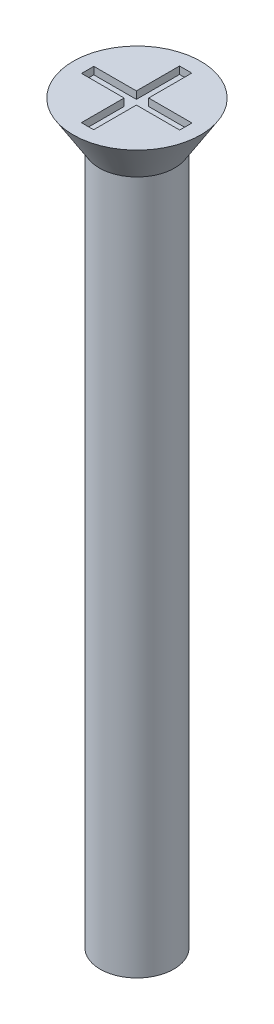
ISO-10303-21;
HEADER;
FILE_DESCRIPTION(('STEP AP214'),'2;1');
FILE_NAME('part.step','',(''),(''),'','','');
FILE_SCHEMA(('AUTOMOTIVE_DESIGN { 1 0 10303 214 1 1 1 1 }'));
ENDSEC;
DATA;
#1=APPLICATION_CONTEXT('core data for automotive mechanical design processes');
#2=APPLICATION_PROTOCOL_DEFINITION('international standard','automotive_design',2000,#1);
#3=PRODUCT_CONTEXT('',#1,'mechanical');
#4=PRODUCT('Part','Part','',(#3));
#5=PRODUCT_RELATED_PRODUCT_CATEGORY('part','',(#4));
#6=PRODUCT_DEFINITION_FORMATION('','',#4);
#7=PRODUCT_DEFINITION_CONTEXT('part definition',#1,'design');
#8=PRODUCT_DEFINITION('design','',#6,#7);
#9=PRODUCT_DEFINITION_SHAPE('','',#8);
#10=(LENGTH_UNIT() NAMED_UNIT(*) SI_UNIT(.MILLI.,.METRE.));
#11=(NAMED_UNIT(*) PLANE_ANGLE_UNIT() SI_UNIT($,.RADIAN.));
#12=(NAMED_UNIT(*) SI_UNIT($,.STERADIAN.) SOLID_ANGLE_UNIT());
#13=UNCERTAINTY_MEASURE_WITH_UNIT(LENGTH_MEASURE(1.E-05),#10,'distance_accuracy_value','');
#14=(GEOMETRIC_REPRESENTATION_CONTEXT(3) GLOBAL_UNCERTAINTY_ASSIGNED_CONTEXT((#13)) GLOBAL_UNIT_ASSIGNED_CONTEXT((#10,
#11,#12)) REPRESENTATION_CONTEXT('',''));
#15=CARTESIAN_POINT('',(0.,0.,0.));
#16=DIRECTION('',(0.,0.,1.));
#17=DIRECTION('',(1.,0.,0.));
#18=AXIS2_PLACEMENT_3D('',#15,#16,#17);
#19=CARTESIAN_POINT('',(0.,30.,0.));
#20=DIRECTION('',(0.,1.,0.));
#21=DIRECTION('',(0.,0.,1.));
#22=AXIS2_PLACEMENT_3D('',#19,#20,#21);
#23=PLANE('',#22);
#24=CARTESIAN_POINT('',(0.,30.,0.));
#25=DIRECTION('',(0.,1.,0.));
#26=DIRECTION('',(0.,0.,1.));
#27=AXIS2_PLACEMENT_3D('',#24,#25,#26);
#28=CIRCLE('',#27,2.6);
#29=CARTESIAN_POINT('',(0.,30.,2.6));
#30=VERTEX_POINT('',#29);
#31=EDGE_CURVE('E192',#30,#30,#28,.T.);
#32=ORIENTED_EDGE('',*,*,#31,.T.);
#33=EDGE_LOOP('',(#32));
#34=FACE_BOUND('',#33,.T.);
#35=DIRECTION('',(1.,0.,0.));
#36=VECTOR('',#35,1.);
#37=CARTESIAN_POINT('',(0.,30.,-2.));
#38=LINE('',#37,#36);
#39=CARTESIAN_POINT('',(-0.265272843023468,30.,-2.));
#40=VERTEX_POINT('',#39);
#41=CARTESIAN_POINT('',(0.234727156976532,30.,-2.));
#42=VERTEX_POINT('',#41);
#43=EDGE_CURVE('E161',#40,#42,#38,.T.);
#44=ORIENTED_EDGE('',*,*,#43,.T.);
#45=DIRECTION('',(0.,0.,1.));
#46=VECTOR('',#45,1.);
#47=CARTESIAN_POINT('',(0.234727156976532,30.,0.));
#48=LINE('',#47,#46);
#49=CARTESIAN_POINT('',(0.234727156976532,30.,-0.241621514992573));
#50=VERTEX_POINT('',#49);
#51=EDGE_CURVE('E48',#42,#50,#48,.T.);
#52=ORIENTED_EDGE('',*,*,#51,.T.);
#53=DIRECTION('',(1.,0.,0.));
#54=VECTOR('',#53,1.);
#55=CARTESIAN_POINT('',(0.,30.,-0.241621514992573));
#56=LINE('',#55,#54);
#57=CARTESIAN_POINT('',(2.,30.,-0.241621514992573));
#58=VERTEX_POINT('',#57);
#59=EDGE_CURVE('E98',#50,#58,#56,.T.);
#60=ORIENTED_EDGE('',*,*,#59,.T.);
#61=DIRECTION('',(0.,0.,1.));
#62=VECTOR('',#61,1.);
#63=CARTESIAN_POINT('',(2.,30.,0.));
#64=LINE('',#63,#62);
#65=CARTESIAN_POINT('',(2.,30.,0.258378485007427));
#66=VERTEX_POINT('',#65);
#67=EDGE_CURVE('E186',#58,#66,#64,.T.);
#68=ORIENTED_EDGE('',*,*,#67,.T.);
#69=DIRECTION('',(1.,0.,0.));
#70=VECTOR('',#69,1.);
#71=CARTESIAN_POINT('',(0.,30.,0.258378485007427));
#72=LINE('',#71,#70);
#73=CARTESIAN_POINT('',(0.234727156976532,30.,0.258378485007427));
#74=VERTEX_POINT('',#73);
#75=EDGE_CURVE('E145',#74,#66,#72,.T.);
#76=ORIENTED_EDGE('',*,*,#75,.F.);
#77=DIRECTION('',(0.,0.,1.));
#78=VECTOR('',#77,1.);
#79=CARTESIAN_POINT('',(0.234727156976532,30.,0.));
#80=LINE('',#79,#78);
#81=CARTESIAN_POINT('',(0.234727156976533,30.,2.));
#82=VERTEX_POINT('',#81);
#83=EDGE_CURVE('E182',#74,#82,#80,.T.);
#84=ORIENTED_EDGE('',*,*,#83,.T.);
#85=DIRECTION('',(1.,0.,0.));
#86=VECTOR('',#85,1.);
#87=CARTESIAN_POINT('',(0.,30.,2.));
#88=LINE('',#87,#86);
#89=CARTESIAN_POINT('',(-0.265272843023467,30.,2.));
#90=VERTEX_POINT('',#89);
#91=EDGE_CURVE('E179',#90,#82,#88,.T.);
#92=ORIENTED_EDGE('',*,*,#91,.F.);
#93=DIRECTION('',(0.,0.,1.));
#94=VECTOR('',#93,1.);
#95=CARTESIAN_POINT('',(-0.265272843023468,30.,0.));
#96=LINE('',#95,#94);
#97=CARTESIAN_POINT('',(-0.265272843023468,30.,0.258378485007427));
#98=VERTEX_POINT('',#97);
#99=EDGE_CURVE('E176',#98,#90,#96,.T.);
#100=ORIENTED_EDGE('',*,*,#99,.F.);
#101=DIRECTION('',(1.,0.,0.));
#102=VECTOR('',#101,1.);
#103=CARTESIAN_POINT('',(0.,30.,0.258378485007427));
#104=LINE('',#103,#102);
#105=CARTESIAN_POINT('',(-2.,30.,0.258378485007427));
#106=VERTEX_POINT('',#105);
#107=EDGE_CURVE('E173',#106,#98,#104,.T.);
#108=ORIENTED_EDGE('',*,*,#107,.F.);
#109=DIRECTION('',(0.,0.,1.));
#110=VECTOR('',#109,1.);
#111=CARTESIAN_POINT('',(-2.,30.,0.));
#112=LINE('',#111,#110);
#113=CARTESIAN_POINT('',(-2.,30.,-0.241621514992573));
#114=VERTEX_POINT('',#113);
#115=EDGE_CURVE('E170',#114,#106,#112,.T.);
#116=ORIENTED_EDGE('',*,*,#115,.F.);
#117=DIRECTION('',(1.,0.,0.));
#118=VECTOR('',#117,1.);
#119=CARTESIAN_POINT('',(0.,30.,-0.241621514992573));
#120=LINE('',#119,#118);
#121=CARTESIAN_POINT('',(-0.265272843023468,30.,-0.241621514992573));
#122=VERTEX_POINT('',#121);
#123=EDGE_CURVE('E167',#114,#122,#120,.T.);
#124=ORIENTED_EDGE('',*,*,#123,.T.);
#125=DIRECTION('',(0.,0.,1.));
#126=VECTOR('',#125,1.);
#127=CARTESIAN_POINT('',(-0.265272843023468,30.,0.));
#128=LINE('',#127,#126);
#129=EDGE_CURVE('E164',#40,#122,#128,.T.);
#130=ORIENTED_EDGE('',*,*,#129,.F.);
#131=EDGE_LOOP('',(#44,#52,#60,#68,#76,#84,#92,#100,#108,#116,#124,#130));
#132=FACE_BOUND('',#131,.T.);
#133=ADVANCED_FACE('F33',(#34,#132),#23,.T.);
#134=CARTESIAN_POINT('',(0.,30.,0.));
#135=DIRECTION('',(0.,-1.,0.));
#136=DIRECTION('',(0.,0.,-1.));
#137=AXIS2_PLACEMENT_3D('',#134,#135,#136);
#138=CYLINDRICAL_SURFACE('',#137,1.5);
#139=CARTESIAN_POINT('',(0.,0.,0.));
#140=DIRECTION('',(0.,1.,0.));
#141=DIRECTION('',(0.,0.,1.));
#142=AXIS2_PLACEMENT_3D('',#139,#140,#141);
#143=CIRCLE('',#142,1.5);
#144=CARTESIAN_POINT('',(0.,0.,1.5));
#145=VERTEX_POINT('',#144);
#146=EDGE_CURVE('E41',#145,#145,#143,.T.);
#147=ORIENTED_EDGE('',*,*,#146,.T.);
#148=EDGE_LOOP('',(#147));
#149=FACE_BOUND('',#148,.T.);
#150=CARTESIAN_POINT('',(0.,28.3,0.));
#151=DIRECTION('',(0.,1.,0.));
#152=DIRECTION('',(0.,0.,1.));
#153=AXIS2_PLACEMENT_3D('',#150,#151,#152);
#154=CIRCLE('',#153,1.5);
#155=CARTESIAN_POINT('',(0.,28.3,1.5));
#156=VERTEX_POINT('',#155);
#157=EDGE_CURVE('E11',#156,#156,#154,.T.);
#158=ORIENTED_EDGE('',*,*,#157,.F.);
#159=EDGE_LOOP('',(#158));
#160=FACE_BOUND('',#159,.T.);
#161=ADVANCED_FACE('F35',(#149,#160),#138,.T.);
#162=CARTESIAN_POINT('',(0.,0.,0.));
#163=DIRECTION('',(0.,1.,0.));
#164=DIRECTION('',(0.,0.,1.));
#165=AXIS2_PLACEMENT_3D('',#162,#163,#164);
#166=PLANE('',#165);
#167=ORIENTED_EDGE('',*,*,#146,.F.);
#168=EDGE_LOOP('',(#167));
#169=FACE_BOUND('',#168,.T.);
#170=ADVANCED_FACE('F219',(#169),#166,.F.);
#171=CARTESIAN_POINT('',(0.,30.,0.));
#172=DIRECTION('',(0.,1.,0.));
#173=DIRECTION('',(0.,0.,1.));
#174=AXIS2_PLACEMENT_3D('',#171,#172,#173);
#175=CONICAL_SURFACE('',#174,2.6,0.558505360638187);
#176=CARTESIAN_POINT('',(0.,28.3,0.));
#177=DIRECTION('',(0.,1.,0.));
#178=DIRECTION('',(0.,0.,1.));
#179=AXIS2_PLACEMENT_3D('',#176,#177,#178);
#180=CIRCLE('',#179,1.53772210175414);
#181=CARTESIAN_POINT('',(0.,28.3,1.53772210175414));
#182=VERTEX_POINT('',#181);
#183=EDGE_CURVE('E212',#182,#182,#180,.T.);
#184=ORIENTED_EDGE('',*,*,#183,.T.);
#185=EDGE_LOOP('',(#184));
#186=FACE_BOUND('',#185,.T.);
#187=ORIENTED_EDGE('',*,*,#31,.F.);
#188=EDGE_LOOP('',(#187));
#189=FACE_BOUND('',#188,.T.);
#190=ADVANCED_FACE('F221',(#186,#189),#175,.T.);
#191=CARTESIAN_POINT('',(0.,28.3,0.));
#192=DIRECTION('',(0.,1.,0.));
#193=DIRECTION('',(0.,0.,1.));
#194=AXIS2_PLACEMENT_3D('',#191,#192,#193);
#195=PLANE('',#194);
#196=ORIENTED_EDGE('',*,*,#157,.T.);
#197=EDGE_LOOP('',(#196));
#198=FACE_BOUND('',#197,.T.);
#199=ORIENTED_EDGE('',*,*,#183,.F.);
#200=EDGE_LOOP('',(#199));
#201=FACE_BOUND('',#200,.T.);
#202=ADVANCED_FACE('F226',(#198,#201),#195,.F.);
#203=CARTESIAN_POINT('',(0.234727156976532,29.7,0.));
#204=DIRECTION('',(-1.,0.,0.));
#205=DIRECTION('',(0.,0.,1.));
#206=AXIS2_PLACEMENT_3D('',#203,#204,#205);
#207=PLANE('',#206);
#208=ORIENTED_EDGE('',*,*,#51,.F.);
#209=DIRECTION('',(0.,1.,0.));
#210=VECTOR('',#209,1.);
#211=CARTESIAN_POINT('',(0.234727156976532,29.7,-2.));
#212=LINE('',#211,#210);
#213=CARTESIAN_POINT('',(0.234727156976532,29.7,-2.));
#214=VERTEX_POINT('',#213);
#215=EDGE_CURVE('E159',#214,#42,#212,.T.);
#216=ORIENTED_EDGE('',*,*,#215,.F.);
#217=DIRECTION('',(0.,0.,1.));
#218=VECTOR('',#217,1.);
#219=CARTESIAN_POINT('',(0.234727156976532,29.7,0.));
#220=LINE('',#219,#218);
#221=CARTESIAN_POINT('',(0.234727156976532,29.7,-0.241621514992573));
#222=VERTEX_POINT('',#221);
#223=EDGE_CURVE('E189',#214,#222,#220,.T.);
#224=ORIENTED_EDGE('',*,*,#223,.T.);
#225=DIRECTION('',(0.,1.,0.));
#226=VECTOR('',#225,1.);
#227=CARTESIAN_POINT('',(0.234727156976532,29.7,-0.241621514992573));
#228=LINE('',#227,#226);
#229=EDGE_CURVE('E190',#222,#50,#228,.T.);
#230=ORIENTED_EDGE('',*,*,#229,.T.);
#231=EDGE_LOOP('',(#208,#216,#224,#230));
#232=FACE_BOUND('',#231,.T.);
#233=ADVANCED_FACE('F238',(#232),#207,.T.);
#234=CARTESIAN_POINT('',(0.,29.7,-0.241621514992573));
#235=DIRECTION('',(0.,0.,1.));
#236=DIRECTION('',(1.,0.,0.));
#237=AXIS2_PLACEMENT_3D('',#234,#235,#236);
#238=PLANE('',#237);
#239=ORIENTED_EDGE('',*,*,#59,.F.);
#240=ORIENTED_EDGE('',*,*,#229,.F.);
#241=DIRECTION('',(1.,0.,0.));
#242=VECTOR('',#241,1.);
#243=CARTESIAN_POINT('',(0.,29.7,-0.241621514992573));
#244=LINE('',#243,#242);
#245=CARTESIAN_POINT('',(2.,29.7,-0.241621514992573));
#246=VERTEX_POINT('',#245);
#247=EDGE_CURVE('E57',#222,#246,#244,.T.);
#248=ORIENTED_EDGE('',*,*,#247,.T.);
#249=DIRECTION('',(0.,1.,0.));
#250=VECTOR('',#249,1.);
#251=CARTESIAN_POINT('',(2.,29.7,-0.241621514992573));
#252=LINE('',#251,#250);
#253=EDGE_CURVE('E137',#246,#58,#252,.T.);
#254=ORIENTED_EDGE('',*,*,#253,.T.);
#255=EDGE_LOOP('',(#239,#240,#248,#254));
#256=FACE_BOUND('',#255,.T.);
#257=ADVANCED_FACE('F242',(#256),#238,.T.);
#258=CARTESIAN_POINT('',(2.,29.7,0.));
#259=DIRECTION('',(-1.,0.,0.));
#260=DIRECTION('',(0.,0.,1.));
#261=AXIS2_PLACEMENT_3D('',#258,#259,#260);
#262=PLANE('',#261);
#263=ORIENTED_EDGE('',*,*,#67,.F.);
#264=ORIENTED_EDGE('',*,*,#253,.F.);
#265=DIRECTION('',(0.,0.,1.));
#266=VECTOR('',#265,1.);
#267=CARTESIAN_POINT('',(2.,29.7,0.));
#268=LINE('',#267,#266);
#269=CARTESIAN_POINT('',(2.,29.7,0.258378485007427));
#270=VERTEX_POINT('',#269);
#271=EDGE_CURVE('E131',#246,#270,#268,.T.);
#272=ORIENTED_EDGE('',*,*,#271,.T.);
#273=DIRECTION('',(0.,1.,0.));
#274=VECTOR('',#273,1.);
#275=CARTESIAN_POINT('',(2.,29.7,0.258378485007427));
#276=LINE('',#275,#274);
#277=EDGE_CURVE('E135',#270,#66,#276,.T.);
#278=ORIENTED_EDGE('',*,*,#277,.T.);
#279=EDGE_LOOP('',(#263,#264,#272,#278));
#280=FACE_BOUND('',#279,.T.);
#281=ADVANCED_FACE('F134',(#280),#262,.T.);
#282=CARTESIAN_POINT('',(0.,29.7,0.258378485007427));
#283=DIRECTION('',(0.,0.,1.));
#284=DIRECTION('',(1.,0.,0.));
#285=AXIS2_PLACEMENT_3D('',#282,#283,#284);
#286=PLANE('',#285);
#287=ORIENTED_EDGE('',*,*,#75,.T.);
#288=ORIENTED_EDGE('',*,*,#277,.F.);
#289=DIRECTION('',(1.,0.,0.));
#290=VECTOR('',#289,1.);
#291=CARTESIAN_POINT('',(0.,29.7,0.258378485007427));
#292=LINE('',#291,#290);
#293=CARTESIAN_POINT('',(0.234727156976532,29.7,0.258378485007427));
#294=VERTEX_POINT('',#293);
#295=EDGE_CURVE('E139',#294,#270,#292,.T.);
#296=ORIENTED_EDGE('',*,*,#295,.F.);
#297=DIRECTION('',(0.,1.,0.));
#298=VECTOR('',#297,1.);
#299=CARTESIAN_POINT('',(0.234727156976532,29.7,0.258378485007427));
#300=LINE('',#299,#298);
#301=EDGE_CURVE('E147',#294,#74,#300,.T.);
#302=ORIENTED_EDGE('',*,*,#301,.T.);
#303=EDGE_LOOP('',(#287,#288,#296,#302));
#304=FACE_BOUND('',#303,.T.);
#305=ADVANCED_FACE('F143',(#304),#286,.F.);
#306=CARTESIAN_POINT('',(0.234727156976532,29.7,0.));
#307=DIRECTION('',(-1.,0.,0.));
#308=DIRECTION('',(0.,0.,1.));
#309=AXIS2_PLACEMENT_3D('',#306,#307,#308);
#310=PLANE('',#309);
#311=ORIENTED_EDGE('',*,*,#83,.F.);
#312=ORIENTED_EDGE('',*,*,#301,.F.);
#313=DIRECTION('',(0.,0.,1.));
#314=VECTOR('',#313,1.);
#315=CARTESIAN_POINT('',(0.234727156976532,29.7,0.));
#316=LINE('',#315,#314);
#317=CARTESIAN_POINT('',(0.234727156976533,29.7,2.));
#318=VERTEX_POINT('',#317);
#319=EDGE_CURVE('E152',#294,#318,#316,.T.);
#320=ORIENTED_EDGE('',*,*,#319,.T.);
#321=DIRECTION('',(0.,1.,0.));
#322=VECTOR('',#321,1.);
#323=CARTESIAN_POINT('',(0.234727156976533,29.7,2.));
#324=LINE('',#323,#322);
#325=EDGE_CURVE('E195',#318,#82,#324,.T.);
#326=ORIENTED_EDGE('',*,*,#325,.T.);
#327=EDGE_LOOP('',(#311,#312,#320,#326));
#328=FACE_BOUND('',#327,.T.);
#329=ADVANCED_FACE('F269',(#328),#310,.T.);
#330=CARTESIAN_POINT('',(0.,29.7,2.));
#331=DIRECTION('',(0.,0.,1.));
#332=DIRECTION('',(1.,0.,0.));
#333=AXIS2_PLACEMENT_3D('',#330,#331,#332);
#334=PLANE('',#333);
#335=ORIENTED_EDGE('',*,*,#91,.T.);
#336=ORIENTED_EDGE('',*,*,#325,.F.);
#337=DIRECTION('',(1.,0.,0.));
#338=VECTOR('',#337,1.);
#339=CARTESIAN_POINT('',(0.,29.7,2.));
#340=LINE('',#339,#338);
#341=CARTESIAN_POINT('',(-0.265272843023467,29.7,2.));
#342=VERTEX_POINT('',#341);
#343=EDGE_CURVE('E154',#342,#318,#340,.T.);
#344=ORIENTED_EDGE('',*,*,#343,.F.);
#345=DIRECTION('',(0.,1.,0.));
#346=VECTOR('',#345,1.);
#347=CARTESIAN_POINT('',(-0.265272843023467,29.7,2.));
#348=LINE('',#347,#346);
#349=EDGE_CURVE('E197',#342,#90,#348,.T.);
#350=ORIENTED_EDGE('',*,*,#349,.T.);
#351=EDGE_LOOP('',(#335,#336,#344,#350));
#352=FACE_BOUND('',#351,.T.);
#353=ADVANCED_FACE('F265',(#352),#334,.F.);
#354=CARTESIAN_POINT('',(-0.265272843023468,29.7,0.));
#355=DIRECTION('',(-1.,0.,0.));
#356=DIRECTION('',(0.,0.,1.));
#357=AXIS2_PLACEMENT_3D('',#354,#355,#356);
#358=PLANE('',#357);
#359=ORIENTED_EDGE('',*,*,#99,.T.);
#360=ORIENTED_EDGE('',*,*,#349,.F.);
#361=DIRECTION('',(0.,0.,1.));
#362=VECTOR('',#361,1.);
#363=CARTESIAN_POINT('',(-0.265272843023468,29.7,0.));
#364=LINE('',#363,#362);
#365=CARTESIAN_POINT('',(-0.265272843023468,29.7,0.258378485007427));
#366=VERTEX_POINT('',#365);
#367=EDGE_CURVE('E417',#366,#342,#364,.T.);
#368=ORIENTED_EDGE('',*,*,#367,.F.);
#369=DIRECTION('',(0.,1.,0.));
#370=VECTOR('',#369,1.);
#371=CARTESIAN_POINT('',(-0.265272843023468,29.7,0.258378485007427));
#372=LINE('',#371,#370);
#373=EDGE_CURVE('E199',#366,#98,#372,.T.);
#374=ORIENTED_EDGE('',*,*,#373,.T.);
#375=EDGE_LOOP('',(#359,#360,#368,#374));
#376=FACE_BOUND('',#375,.T.);
#377=ADVANCED_FACE('F261',(#376),#358,.F.);
#378=CARTESIAN_POINT('',(0.,29.7,0.258378485007427));
#379=DIRECTION('',(0.,0.,1.));
#380=DIRECTION('',(1.,0.,0.));
#381=AXIS2_PLACEMENT_3D('',#378,#379,#380);
#382=PLANE('',#381);
#383=ORIENTED_EDGE('',*,*,#107,.T.);
#384=ORIENTED_EDGE('',*,*,#373,.F.);
#385=DIRECTION('',(1.,0.,0.));
#386=VECTOR('',#385,1.);
#387=CARTESIAN_POINT('',(0.,29.7,0.258378485007427));
#388=LINE('',#387,#386);
#389=CARTESIAN_POINT('',(-2.,29.7,0.258378485007427));
#390=VERTEX_POINT('',#389);
#391=EDGE_CURVE('E414',#390,#366,#388,.T.);
#392=ORIENTED_EDGE('',*,*,#391,.F.);
#393=DIRECTION('',(0.,1.,0.));
#394=VECTOR('',#393,1.);
#395=CARTESIAN_POINT('',(-2.,29.7,0.258378485007427));
#396=LINE('',#395,#394);
#397=EDGE_CURVE('E201',#390,#106,#396,.T.);
#398=ORIENTED_EDGE('',*,*,#397,.T.);
#399=EDGE_LOOP('',(#383,#384,#392,#398));
#400=FACE_BOUND('',#399,.T.);
#401=ADVANCED_FACE('F257',(#400),#382,.F.);
#402=CARTESIAN_POINT('',(-2.,29.7,0.));
#403=DIRECTION('',(-1.,0.,0.));
#404=DIRECTION('',(0.,0.,1.));
#405=AXIS2_PLACEMENT_3D('',#402,#403,#404);
#406=PLANE('',#405);
#407=ORIENTED_EDGE('',*,*,#115,.T.);
#408=ORIENTED_EDGE('',*,*,#397,.F.);
#409=DIRECTION('',(0.,0.,1.));
#410=VECTOR('',#409,1.);
#411=CARTESIAN_POINT('',(-2.,29.7,0.));
#412=LINE('',#411,#410);
#413=CARTESIAN_POINT('',(-2.,29.7,-0.241621514992573));
#414=VERTEX_POINT('',#413);
#415=EDGE_CURVE('E411',#414,#390,#412,.T.);
#416=ORIENTED_EDGE('',*,*,#415,.F.);
#417=DIRECTION('',(0.,1.,0.));
#418=VECTOR('',#417,1.);
#419=CARTESIAN_POINT('',(-2.,29.7,-0.241621514992573));
#420=LINE('',#419,#418);
#421=EDGE_CURVE('E203',#414,#114,#420,.T.);
#422=ORIENTED_EDGE('',*,*,#421,.T.);
#423=EDGE_LOOP('',(#407,#408,#416,#422));
#424=FACE_BOUND('',#423,.T.);
#425=ADVANCED_FACE('F253',(#424),#406,.F.);
#426=CARTESIAN_POINT('',(0.,29.7,-0.241621514992573));
#427=DIRECTION('',(0.,0.,1.));
#428=DIRECTION('',(1.,0.,0.));
#429=AXIS2_PLACEMENT_3D('',#426,#427,#428);
#430=PLANE('',#429);
#431=ORIENTED_EDGE('',*,*,#123,.F.);
#432=ORIENTED_EDGE('',*,*,#421,.F.);
#433=DIRECTION('',(1.,0.,0.));
#434=VECTOR('',#433,1.);
#435=CARTESIAN_POINT('',(0.,29.7,-0.241621514992573));
#436=LINE('',#435,#434);
#437=CARTESIAN_POINT('',(-0.265272843023468,29.7,-0.241621514992573));
#438=VERTEX_POINT('',#437);
#439=EDGE_CURVE('E409',#414,#438,#436,.T.);
#440=ORIENTED_EDGE('',*,*,#439,.T.);
#441=DIRECTION('',(0.,1.,0.));
#442=VECTOR('',#441,1.);
#443=CARTESIAN_POINT('',(-0.265272843023468,29.7,-0.241621514992573));
#444=LINE('',#443,#442);
#445=EDGE_CURVE('E205',#438,#122,#444,.T.);
#446=ORIENTED_EDGE('',*,*,#445,.T.);
#447=EDGE_LOOP('',(#431,#432,#440,#446));
#448=FACE_BOUND('',#447,.T.);
#449=ADVANCED_FACE('F249',(#448),#430,.T.);
#450=CARTESIAN_POINT('',(-0.265272843023468,29.7,0.));
#451=DIRECTION('',(-1.,0.,0.));
#452=DIRECTION('',(0.,0.,1.));
#453=AXIS2_PLACEMENT_3D('',#450,#451,#452);
#454=PLANE('',#453);
#455=ORIENTED_EDGE('',*,*,#129,.T.);
#456=ORIENTED_EDGE('',*,*,#445,.F.);
#457=DIRECTION('',(0.,0.,1.));
#458=VECTOR('',#457,1.);
#459=CARTESIAN_POINT('',(-0.265272843023468,29.7,0.));
#460=LINE('',#459,#458);
#461=CARTESIAN_POINT('',(-0.265272843023468,29.7,-2.));
#462=VERTEX_POINT('',#461);
#463=EDGE_CURVE('E405',#462,#438,#460,.T.);
#464=ORIENTED_EDGE('',*,*,#463,.F.);
#465=DIRECTION('',(0.,1.,0.));
#466=VECTOR('',#465,1.);
#467=CARTESIAN_POINT('',(-0.265272843023468,29.7,-2.));
#468=LINE('',#467,#466);
#469=EDGE_CURVE('E207',#462,#40,#468,.T.);
#470=ORIENTED_EDGE('',*,*,#469,.T.);
#471=EDGE_LOOP('',(#455,#456,#464,#470));
#472=FACE_BOUND('',#471,.T.);
#473=ADVANCED_FACE('F246',(#472),#454,.F.);
#474=CARTESIAN_POINT('',(0.,29.7,-2.));
#475=DIRECTION('',(0.,0.,1.));
#476=DIRECTION('',(1.,0.,0.));
#477=AXIS2_PLACEMENT_3D('',#474,#475,#476);
#478=PLANE('',#477);
#479=ORIENTED_EDGE('',*,*,#43,.F.);
#480=ORIENTED_EDGE('',*,*,#469,.F.);
#481=DIRECTION('',(1.,0.,0.));
#482=VECTOR('',#481,1.);
#483=CARTESIAN_POINT('',(0.,29.7,-2.));
#484=LINE('',#483,#482);
#485=EDGE_CURVE('E105',#462,#214,#484,.T.);
#486=ORIENTED_EDGE('',*,*,#485,.T.);
#487=ORIENTED_EDGE('',*,*,#215,.T.);
#488=EDGE_LOOP('',(#479,#480,#486,#487));
#489=FACE_BOUND('',#488,.T.);
#490=ADVANCED_FACE('F243',(#489),#478,.T.);
#491=CARTESIAN_POINT('',(0.,29.7,0.));
#492=DIRECTION('',(0.,1.,0.));
#493=DIRECTION('',(0.,0.,1.));
#494=AXIS2_PLACEMENT_3D('',#491,#492,#493);
#495=PLANE('',#494);
#496=ORIENTED_EDGE('',*,*,#223,.F.);
#497=ORIENTED_EDGE('',*,*,#485,.F.);
#498=ORIENTED_EDGE('',*,*,#463,.T.);
#499=ORIENTED_EDGE('',*,*,#439,.F.);
#500=ORIENTED_EDGE('',*,*,#415,.T.);
#501=ORIENTED_EDGE('',*,*,#391,.T.);
#502=ORIENTED_EDGE('',*,*,#367,.T.);
#503=ORIENTED_EDGE('',*,*,#343,.T.);
#504=ORIENTED_EDGE('',*,*,#319,.F.);
#505=ORIENTED_EDGE('',*,*,#295,.T.);
#506=ORIENTED_EDGE('',*,*,#271,.F.);
#507=ORIENTED_EDGE('',*,*,#247,.F.);
#508=EDGE_LOOP('',(#496,#497,#498,#499,#500,#501,#502,#503,#504,#505,#506,#507));
#509=FACE_BOUND('',#508,.T.);
#510=ADVANCED_FACE('F150',(#509),#495,.T.);
#511=CLOSED_SHELL('',(#133,#161,#170,#190,#202,#233,#257,#281,#305,#329,#353,#377,#401,#425,
#449,#473,#490,#510));
#512=MANIFOLD_SOLID_BREP('B2',#511);
#513=ADVANCED_BREP_SHAPE_REPRESENTATION('',(#18,#512),#14);
#514=SHAPE_DEFINITION_REPRESENTATION(#9,#513);
ENDSEC;
END-ISO-10303-21;
